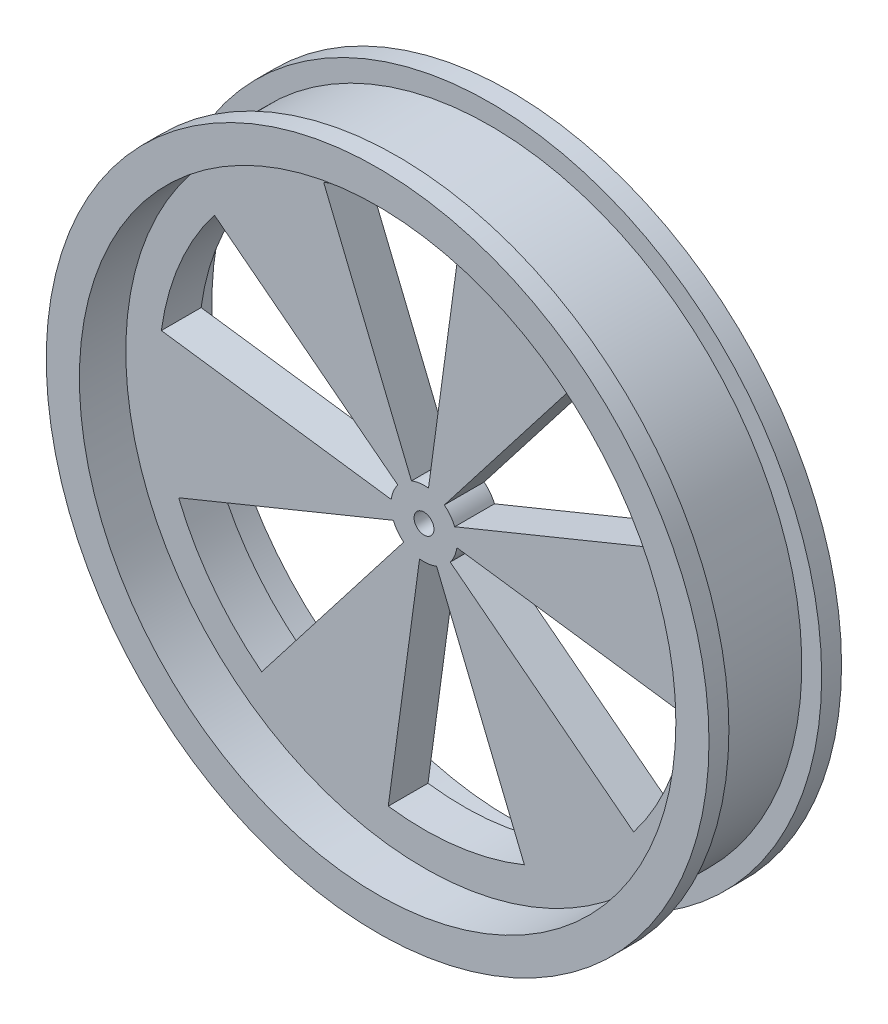
ISO-10303-21;
HEADER;
FILE_DESCRIPTION(('STEP AP214'),'2;1');
FILE_NAME('part.step','',(''),(''),'','','');
FILE_SCHEMA(('AUTOMOTIVE_DESIGN { 1 0 10303 214 1 1 1 1 }'));
ENDSEC;
DATA;
#1=APPLICATION_CONTEXT('core data for automotive mechanical design processes');
#2=APPLICATION_PROTOCOL_DEFINITION('international standard','automotive_design',2000,#1);
#3=PRODUCT_CONTEXT('',#1,'mechanical');
#4=PRODUCT('Part','Part','',(#3));
#5=PRODUCT_RELATED_PRODUCT_CATEGORY('part','',(#4));
#6=PRODUCT_DEFINITION_FORMATION('','',#4);
#7=PRODUCT_DEFINITION_CONTEXT('part definition',#1,'design');
#8=PRODUCT_DEFINITION('design','',#6,#7);
#9=PRODUCT_DEFINITION_SHAPE('','',#8);
#10=(LENGTH_UNIT() NAMED_UNIT(*) SI_UNIT(.MILLI.,.METRE.));
#11=(NAMED_UNIT(*) PLANE_ANGLE_UNIT() SI_UNIT($,.RADIAN.));
#12=(NAMED_UNIT(*) SI_UNIT($,.STERADIAN.) SOLID_ANGLE_UNIT());
#13=UNCERTAINTY_MEASURE_WITH_UNIT(LENGTH_MEASURE(1.E-05),#10,'distance_accuracy_value','');
#14=(GEOMETRIC_REPRESENTATION_CONTEXT(3) GLOBAL_UNCERTAINTY_ASSIGNED_CONTEXT((#13)) GLOBAL_UNIT_ASSIGNED_CONTEXT((#10,
#11,#12)) REPRESENTATION_CONTEXT('',''));
#15=CARTESIAN_POINT('',(0.,0.,0.));
#16=DIRECTION('',(0.,0.,1.));
#17=DIRECTION('',(1.,0.,0.));
#18=AXIS2_PLACEMENT_3D('',#15,#16,#17);
#19=CARTESIAN_POINT('',(0.,0.,20.));
#20=DIRECTION('',(0.,0.,-1.));
#21=DIRECTION('',(-1.,0.,0.));
#22=AXIS2_PLACEMENT_3D('',#19,#20,#21);
#23=CYLINDRICAL_SURFACE('',#22,50.);
#24=CARTESIAN_POINT('',(0.,0.,0.));
#25=DIRECTION('',(0.,0.,1.));
#26=DIRECTION('',(1.,0.,0.));
#27=AXIS2_PLACEMENT_3D('',#24,#25,#26);
#28=CIRCLE('',#27,50.);
#29=CARTESIAN_POINT('',(50.,0.,0.));
#30=VERTEX_POINT('',#29);
#31=EDGE_CURVE('E139',#30,#30,#28,.T.);
#32=ORIENTED_EDGE('',*,*,#31,.T.);
#33=EDGE_LOOP('',(#32));
#34=FACE_BOUND('',#33,.T.);
#35=CARTESIAN_POINT('',(0.,0.,3.00000000000001));
#36=DIRECTION('',(0.,0.,1.));
#37=DIRECTION('',(1.,0.,0.));
#38=AXIS2_PLACEMENT_3D('',#35,#36,#37);
#39=CIRCLE('',#38,50.);
#40=CARTESIAN_POINT('',(50.,0.,3.00000000000001));
#41=VERTEX_POINT('',#40);
#42=EDGE_CURVE('E498',#41,#41,#39,.T.);
#43=ORIENTED_EDGE('',*,*,#42,.F.);
#44=EDGE_LOOP('',(#43));
#45=FACE_BOUND('',#44,.T.);
#46=ADVANCED_FACE('F130',(#34,#45),#23,.T.);
#47=CARTESIAN_POINT('',(0.,0.,7.));
#48=DIRECTION('',(0.,0.,1.));
#49=DIRECTION('',(1.,0.,0.));
#50=AXIS2_PLACEMENT_3D('',#47,#48,#49);
#51=PLANE('',#50);
#52=CARTESIAN_POINT('',(0.,0.,7.));
#53=DIRECTION('',(0.,0.,1.));
#54=DIRECTION('',(1.,0.,0.));
#55=AXIS2_PLACEMENT_3D('',#52,#53,#54);
#56=CIRCLE('',#55,1.5);
#57=CARTESIAN_POINT('',(1.5,0.,7.));
#58=VERTEX_POINT('',#57);
#59=EDGE_CURVE('E811',#58,#58,#56,.F.);
#60=ORIENTED_EDGE('',*,*,#59,.F.);
#61=EDGE_LOOP('',(#60));
#62=FACE_BOUND('',#61,.T.);
#63=CARTESIAN_POINT('',(0.,0.,7.));
#64=DIRECTION('',(0.,0.,1.));
#65=DIRECTION('',(1.,0.,0.));
#66=AXIS2_PLACEMENT_3D('',#63,#64,#65);
#67=CIRCLE('',#66,5.);
#68=CARTESIAN_POINT('',(0.674743038849252,4.9542629957971,7.));
#69=VERTEX_POINT('',#68);
#70=CARTESIAN_POINT('',(-1.89278688522839,4.62788913081411,7.));
#71=VERTEX_POINT('',#70);
#72=EDGE_CURVE('E444',#69,#71,#67,.T.);
#73=ORIENTED_EDGE('',*,*,#72,.F.);
#74=DIRECTION('',(0.13494860776985,0.99085259915942,0.));
#75=VECTOR('',#74,1.);
#76=CARTESIAN_POINT('',(0.,0.,7.));
#77=LINE('',#76,#75);
#78=CARTESIAN_POINT('',(5.39794431079402,39.6341039663768,7.));
#79=VERTEX_POINT('',#78);
#80=EDGE_CURVE('E436',#69,#79,#77,.T.);
#81=ORIENTED_EDGE('',*,*,#80,.T.);
#82=CARTESIAN_POINT('',(0.,0.,7.));
#83=DIRECTION('',(0.,0.,1.));
#84=DIRECTION('',(1.,0.,0.));
#85=AXIS2_PLACEMENT_3D('',#82,#83,#84);
#86=CIRCLE('',#85,40.);
#87=CARTESIAN_POINT('',(-15.1422950818272,37.0231130465129,7.));
#88=VERTEX_POINT('',#87);
#89=EDGE_CURVE('E439',#79,#88,#86,.T.);
#90=ORIENTED_EDGE('',*,*,#89,.T.);
#91=DIRECTION('',(-0.378557377045679,0.925577826162822,0.));
#92=VECTOR('',#91,1.);
#93=CARTESIAN_POINT('',(0.,0.,7.));
#94=LINE('',#93,#92);
#95=EDGE_CURVE('E442',#71,#88,#94,.T.);
#96=ORIENTED_EDGE('',*,*,#95,.F.);
#97=EDGE_LOOP('',(#73,#81,#90,#96));
#98=FACE_BOUND('',#97,.T.);
#99=CARTESIAN_POINT('',(0.,0.,7.));
#100=DIRECTION('',(0.,0.,1.));
#101=DIRECTION('',(1.,0.,0.));
#102=AXIS2_PLACEMENT_3D('',#99,#100,#101);
#103=CIRCLE('',#102,5.);
#104=CARTESIAN_POINT('',(3.95314609196489,-3.06147611056868,7.));
#105=VERTEX_POINT('',#104);
#106=CARTESIAN_POINT('',(4.95426299579711,-0.6747430388492,7.));
#107=VERTEX_POINT('',#106);
#108=EDGE_CURVE('E424',#105,#107,#103,.T.);
#109=ORIENTED_EDGE('',*,*,#108,.F.);
#110=DIRECTION('',(0.790629218392978,-0.612295222113735,0.));
#111=VECTOR('',#110,1.);
#112=CARTESIAN_POINT('',(0.,0.,7.));
#113=LINE('',#112,#111);
#114=CARTESIAN_POINT('',(31.6251687357191,-24.4918088845494,7.));
#115=VERTEX_POINT('',#114);
#116=EDGE_CURVE('E416',#105,#115,#113,.T.);
#117=ORIENTED_EDGE('',*,*,#116,.T.);
#118=CARTESIAN_POINT('',(0.,0.,7.));
#119=DIRECTION('',(0.,0.,1.));
#120=DIRECTION('',(1.,0.,0.));
#121=AXIS2_PLACEMENT_3D('',#118,#119,#120);
#122=CIRCLE('',#121,40.);
#123=CARTESIAN_POINT('',(39.6341039663769,-5.3979443107936,7.));
#124=VERTEX_POINT('',#123);
#125=EDGE_CURVE('E419',#115,#124,#122,.T.);
#126=ORIENTED_EDGE('',*,*,#125,.T.);
#127=DIRECTION('',(0.990852599159422,-0.13494860776984,0.));
#128=VECTOR('',#127,1.);
#129=CARTESIAN_POINT('',(0.,0.,7.));
#130=LINE('',#129,#128);
#131=EDGE_CURVE('E422',#107,#124,#130,.T.);
#132=ORIENTED_EDGE('',*,*,#131,.F.);
#133=EDGE_LOOP('',(#109,#117,#126,#132));
#134=FACE_BOUND('',#133,.T.);
#135=CARTESIAN_POINT('',(0.,0.,7.));
#136=DIRECTION('',(0.,0.,1.));
#137=DIRECTION('',(1.,0.,0.));
#138=AXIS2_PLACEMENT_3D('',#135,#136,#137);
#139=CIRCLE('',#138,5.);
#140=CARTESIAN_POINT('',(4.62788913081409,1.89278688522844,7.));
#141=VERTEX_POINT('',#140);
#142=CARTESIAN_POINT('',(3.06147611056872,3.95314609196486,7.));
#143=VERTEX_POINT('',#142);
#144=EDGE_CURVE('E482',#141,#143,#139,.T.);
#145=ORIENTED_EDGE('',*,*,#144,.F.);
#146=DIRECTION('',(0.925577826162818,0.378557377045689,0.));
#147=VECTOR('',#146,1.);
#148=CARTESIAN_POINT('',(0.,0.,7.));
#149=LINE('',#148,#147);
#150=CARTESIAN_POINT('',(37.0231130465127,15.1422950818275,7.));
#151=VERTEX_POINT('',#150);
#152=EDGE_CURVE('E468',#141,#151,#149,.T.);
#153=ORIENTED_EDGE('',*,*,#152,.T.);
#154=CARTESIAN_POINT('',(0.,0.,7.));
#155=DIRECTION('',(0.,0.,1.));
#156=DIRECTION('',(1.,0.,0.));
#157=AXIS2_PLACEMENT_3D('',#154,#155,#156);
#158=CIRCLE('',#157,40.);
#159=CARTESIAN_POINT('',(24.4918088845497,31.6251687357189,7.));
#160=VERTEX_POINT('',#159);
#161=EDGE_CURVE('E477',#151,#160,#158,.T.);
#162=ORIENTED_EDGE('',*,*,#161,.T.);
#163=DIRECTION('',(0.612295222113744,0.790629218392972,0.));
#164=VECTOR('',#163,1.);
#165=CARTESIAN_POINT('',(0.,0.,7.));
#166=LINE('',#165,#164);
#167=EDGE_CURVE('E480',#143,#160,#166,.T.);
#168=ORIENTED_EDGE('',*,*,#167,.F.);
#169=EDGE_LOOP('',(#145,#153,#162,#168));
#170=FACE_BOUND('',#169,.T.);
#171=CARTESIAN_POINT('',(0.,0.,7.));
#172=DIRECTION('',(0.,0.,1.));
#173=DIRECTION('',(1.,0.,0.));
#174=AXIS2_PLACEMENT_3D('',#171,#172,#173);
#175=CIRCLE('',#174,45.);
#176=CARTESIAN_POINT('',(45.,0.,7.));
#177=VERTEX_POINT('',#176);
#178=EDGE_CURVE('E491',#177,#177,#175,.T.);
#179=ORIENTED_EDGE('',*,*,#178,.F.);
#180=EDGE_LOOP('',(#179));
#181=FACE_BOUND('',#180,.T.);
#182=CARTESIAN_POINT('',(0.,0.,7.));
#183=DIRECTION('',(0.,0.,1.));
#184=DIRECTION('',(1.,0.,0.));
#185=AXIS2_PLACEMENT_3D('',#182,#183,#184);
#186=CIRCLE('',#185,5.);
#187=CARTESIAN_POINT('',(-4.6278891308141,-1.89278688522841,7.));
#188=VERTEX_POINT('',#187);
#189=CARTESIAN_POINT('',(-3.06147611056869,-3.95314609196488,7.));
#190=VERTEX_POINT('',#189);
#191=EDGE_CURVE('E414',#188,#190,#186,.T.);
#192=ORIENTED_EDGE('',*,*,#191,.F.);
#193=DIRECTION('',(-0.925577826162821,-0.378557377045682,0.));
#194=VECTOR('',#193,1.);
#195=CARTESIAN_POINT('',(0.,0.,7.));
#196=LINE('',#195,#194);
#197=CARTESIAN_POINT('',(-37.0231130465128,-15.1422950818273,7.));
#198=VERTEX_POINT('',#197);
#199=EDGE_CURVE('E337',#188,#198,#196,.T.);
#200=ORIENTED_EDGE('',*,*,#199,.T.);
#201=CARTESIAN_POINT('',(0.,0.,7.));
#202=DIRECTION('',(0.,0.,1.));
#203=DIRECTION('',(1.,0.,0.));
#204=AXIS2_PLACEMENT_3D('',#201,#202,#203);
#205=CIRCLE('',#204,40.);
#206=CARTESIAN_POINT('',(-24.4918088845495,-31.6251687357191,7.));
#207=VERTEX_POINT('',#206);
#208=EDGE_CURVE('E409',#198,#207,#205,.T.);
#209=ORIENTED_EDGE('',*,*,#208,.T.);
#210=DIRECTION('',(-0.612295222113738,-0.790629218392976,0.));
#211=VECTOR('',#210,1.);
#212=CARTESIAN_POINT('',(0.,0.,7.));
#213=LINE('',#212,#211);
#214=EDGE_CURVE('E412',#190,#207,#213,.T.);
#215=ORIENTED_EDGE('',*,*,#214,.F.);
#216=EDGE_LOOP('',(#192,#200,#209,#215));
#217=FACE_BOUND('',#216,.T.);
#218=CARTESIAN_POINT('',(0.,0.,7.));
#219=DIRECTION('',(0.,0.,1.));
#220=DIRECTION('',(1.,0.,0.));
#221=AXIS2_PLACEMENT_3D('',#218,#219,#220);
#222=CIRCLE('',#221,5.);
#223=CARTESIAN_POINT('',(-0.674743038849217,-4.95426299579711,7.));
#224=VERTEX_POINT('',#223);
#225=CARTESIAN_POINT('',(1.89278688522843,-4.6278891308141,7.));
#226=VERTEX_POINT('',#225);
#227=EDGE_CURVE('E434',#224,#226,#222,.T.);
#228=ORIENTED_EDGE('',*,*,#227,.F.);
#229=DIRECTION('',(-0.134948607769843,-0.990852599159421,0.));
#230=VECTOR('',#229,1.);
#231=CARTESIAN_POINT('',(0.,0.,7.));
#232=LINE('',#231,#230);
#233=CARTESIAN_POINT('',(-5.39794431079374,-39.6341039663769,7.));
#234=VERTEX_POINT('',#233);
#235=EDGE_CURVE('E426',#224,#234,#232,.T.);
#236=ORIENTED_EDGE('',*,*,#235,.T.);
#237=CARTESIAN_POINT('',(0.,0.,7.));
#238=DIRECTION('',(0.,0.,1.));
#239=DIRECTION('',(1.,0.,0.));
#240=AXIS2_PLACEMENT_3D('',#237,#238,#239);
#241=CIRCLE('',#240,40.);
#242=CARTESIAN_POINT('',(15.1422950818274,-37.0231130465128,7.));
#243=VERTEX_POINT('',#242);
#244=EDGE_CURVE('E429',#234,#243,#241,.T.);
#245=ORIENTED_EDGE('',*,*,#244,.T.);
#246=DIRECTION('',(0.378557377045685,-0.92557782616282,0.));
#247=VECTOR('',#246,1.);
#248=CARTESIAN_POINT('',(0.,0.,7.));
#249=LINE('',#248,#247);
#250=EDGE_CURVE('E432',#226,#243,#249,.T.);
#251=ORIENTED_EDGE('',*,*,#250,.F.);
#252=EDGE_LOOP('',(#228,#236,#245,#251));
#253=FACE_BOUND('',#252,.T.);
#254=CARTESIAN_POINT('',(0.,0.,7.));
#255=DIRECTION('',(0.,0.,1.));
#256=DIRECTION('',(1.,0.,0.));
#257=AXIS2_PLACEMENT_3D('',#254,#255,#256);
#258=CIRCLE('',#257,5.);
#259=CARTESIAN_POINT('',(-3.95314609196487,3.0614761105687,7.));
#260=VERTEX_POINT('',#259);
#261=CARTESIAN_POINT('',(-4.9542629957971,0.674743038849235,7.));
#262=VERTEX_POINT('',#261);
#263=EDGE_CURVE('E451',#260,#262,#258,.T.);
#264=ORIENTED_EDGE('',*,*,#263,.F.);
#265=DIRECTION('',(-0.790629218392974,0.612295222113741,0.));
#266=VECTOR('',#265,1.);
#267=CARTESIAN_POINT('',(0.,0.,7.));
#268=LINE('',#267,#266);
#269=CARTESIAN_POINT('',(-31.625168735719,24.4918088845496,7.));
#270=VERTEX_POINT('',#269);
#271=EDGE_CURVE('E446',#260,#270,#268,.T.);
#272=ORIENTED_EDGE('',*,*,#271,.T.);
#273=CARTESIAN_POINT('',(0.,0.,7.));
#274=DIRECTION('',(0.,0.,1.));
#275=DIRECTION('',(1.,0.,0.));
#276=AXIS2_PLACEMENT_3D('',#273,#274,#275);
#277=CIRCLE('',#276,40.);
#278=CARTESIAN_POINT('',(-39.6341039663768,5.39794431079388,7.));
#279=VERTEX_POINT('',#278);
#280=EDGE_CURVE('E298',#270,#279,#277,.T.);
#281=ORIENTED_EDGE('',*,*,#280,.T.);
#282=DIRECTION('',(-0.990852599159421,0.134948607769847,0.));
#283=VECTOR('',#282,1.);
#284=CARTESIAN_POINT('',(0.,0.,7.));
#285=LINE('',#284,#283);
#286=EDGE_CURVE('E449',#262,#279,#285,.T.);
#287=ORIENTED_EDGE('',*,*,#286,.F.);
#288=EDGE_LOOP('',(#264,#272,#281,#287));
#289=FACE_BOUND('',#288,.T.);
#290=ADVANCED_FACE('F523',(#62,#98,#134,#170,#181,#217,#253,#289),#51,.F.);
#291=CARTESIAN_POINT('',(0.,0.,13.));
#292=DIRECTION('',(0.,0.,1.));
#293=DIRECTION('',(1.,0.,0.));
#294=AXIS2_PLACEMENT_3D('',#291,#292,#293);
#295=PLANE('',#294);
#296=CARTESIAN_POINT('',(0.,0.,13.));
#297=DIRECTION('',(0.,0.,1.));
#298=DIRECTION('',(1.,0.,0.));
#299=AXIS2_PLACEMENT_3D('',#296,#297,#298);
#300=CIRCLE('',#299,1.5);
#301=CARTESIAN_POINT('',(1.5,0.,13.));
#302=VERTEX_POINT('',#301);
#303=EDGE_CURVE('E134',#302,#302,#300,.F.);
#304=ORIENTED_EDGE('',*,*,#303,.T.);
#305=EDGE_LOOP('',(#304));
#306=FACE_BOUND('',#305,.T.);
#307=CARTESIAN_POINT('',(0.,0.,13.));
#308=DIRECTION('',(0.,0.,1.));
#309=DIRECTION('',(1.,0.,0.));
#310=AXIS2_PLACEMENT_3D('',#307,#308,#309);
#311=CIRCLE('',#310,45.);
#312=CARTESIAN_POINT('',(45.,0.,13.));
#313=VERTEX_POINT('',#312);
#314=EDGE_CURVE('E485',#313,#313,#311,.T.);
#315=ORIENTED_EDGE('',*,*,#314,.T.);
#316=EDGE_LOOP('',(#315));
#317=FACE_BOUND('',#316,.T.);
#318=DIRECTION('',(0.925577826162818,0.378557377045689,0.));
#319=VECTOR('',#318,1.);
#320=CARTESIAN_POINT('',(0.,0.,13.));
#321=LINE('',#320,#319);
#322=CARTESIAN_POINT('',(4.62788913081409,1.89278688522844,13.));
#323=VERTEX_POINT('',#322);
#324=CARTESIAN_POINT('',(37.0231130465127,15.1422950818275,13.));
#325=VERTEX_POINT('',#324);
#326=EDGE_CURVE('E456',#323,#325,#321,.T.);
#327=ORIENTED_EDGE('',*,*,#326,.F.);
#328=CARTESIAN_POINT('',(0.,0.,13.));
#329=DIRECTION('',(0.,0.,1.));
#330=DIRECTION('',(1.,0.,0.));
#331=AXIS2_PLACEMENT_3D('',#328,#329,#330);
#332=CIRCLE('',#331,5.);
#333=CARTESIAN_POINT('',(3.06147611056872,3.95314609196486,13.));
#334=VERTEX_POINT('',#333);
#335=EDGE_CURVE('E453',#323,#334,#332,.T.);
#336=ORIENTED_EDGE('',*,*,#335,.T.);
#337=DIRECTION('',(0.612295222113743,0.790629218392972,0.));
#338=VECTOR('',#337,1.);
#339=CARTESIAN_POINT('',(0.,0.,13.));
#340=LINE('',#339,#338);
#341=CARTESIAN_POINT('',(24.4918088845497,31.6251687357189,13.));
#342=VERTEX_POINT('',#341);
#343=EDGE_CURVE('E462',#334,#342,#340,.T.);
#344=ORIENTED_EDGE('',*,*,#343,.T.);
#345=CARTESIAN_POINT('',(0.,0.,13.));
#346=DIRECTION('',(0.,0.,1.));
#347=DIRECTION('',(1.,0.,0.));
#348=AXIS2_PLACEMENT_3D('',#345,#346,#347);
#349=CIRCLE('',#348,40.);
#350=EDGE_CURVE('E459',#325,#342,#349,.T.);
#351=ORIENTED_EDGE('',*,*,#350,.F.);
#352=EDGE_LOOP('',(#327,#336,#344,#351));
#353=FACE_BOUND('',#352,.T.);
#354=DIRECTION('',(-0.925577826162821,-0.378557377045682,0.));
#355=VECTOR('',#354,1.);
#356=CARTESIAN_POINT('',(0.,0.,13.));
#357=LINE('',#356,#355);
#358=CARTESIAN_POINT('',(-4.6278891308141,-1.89278688522841,13.));
#359=VERTEX_POINT('',#358);
#360=CARTESIAN_POINT('',(-37.0231130465128,-15.1422950818273,13.));
#361=VERTEX_POINT('',#360);
#362=EDGE_CURVE('E389',#359,#361,#357,.T.);
#363=ORIENTED_EDGE('',*,*,#362,.F.);
#364=CARTESIAN_POINT('',(0.,0.,13.));
#365=DIRECTION('',(0.,0.,1.));
#366=DIRECTION('',(1.,0.,0.));
#367=AXIS2_PLACEMENT_3D('',#364,#365,#366);
#368=CIRCLE('',#367,5.);
#369=CARTESIAN_POINT('',(-3.06147611056869,-3.95314609196488,13.));
#370=VERTEX_POINT('',#369);
#371=EDGE_CURVE('E380',#359,#370,#368,.T.);
#372=ORIENTED_EDGE('',*,*,#371,.T.);
#373=DIRECTION('',(-0.612295222113738,-0.790629218392976,0.));
#374=VECTOR('',#373,1.);
#375=CARTESIAN_POINT('',(0.,0.,13.));
#376=LINE('',#375,#374);
#377=CARTESIAN_POINT('',(-24.4918088845495,-31.6251687357191,13.));
#378=VERTEX_POINT('',#377);
#379=EDGE_CURVE('E395',#370,#378,#376,.T.);
#380=ORIENTED_EDGE('',*,*,#379,.T.);
#381=CARTESIAN_POINT('',(0.,0.,13.));
#382=DIRECTION('',(0.,0.,1.));
#383=DIRECTION('',(1.,0.,0.));
#384=AXIS2_PLACEMENT_3D('',#381,#382,#383);
#385=CIRCLE('',#384,40.);
#386=EDGE_CURVE('E392',#361,#378,#385,.T.);
#387=ORIENTED_EDGE('',*,*,#386,.F.);
#388=EDGE_LOOP('',(#363,#372,#380,#387));
#389=FACE_BOUND('',#388,.T.);
#390=DIRECTION('',(0.790629218392978,-0.612295222113735,0.));
#391=VECTOR('',#390,1.);
#392=CARTESIAN_POINT('',(0.,0.,13.));
#393=LINE('',#392,#391);
#394=CARTESIAN_POINT('',(3.95314609196489,-3.06147611056868,13.));
#395=VERTEX_POINT('',#394);
#396=CARTESIAN_POINT('',(31.6251687357191,-24.4918088845494,13.));
#397=VERTEX_POINT('',#396);
#398=EDGE_CURVE('E346',#395,#397,#393,.T.);
#399=ORIENTED_EDGE('',*,*,#398,.F.);
#400=CARTESIAN_POINT('',(0.,0.,13.));
#401=DIRECTION('',(0.,0.,1.));
#402=DIRECTION('',(1.,0.,0.));
#403=AXIS2_PLACEMENT_3D('',#400,#401,#402);
#404=CIRCLE('',#403,5.);
#405=CARTESIAN_POINT('',(4.95426299579711,-0.6747430388492,13.));
#406=VERTEX_POINT('',#405);
#407=EDGE_CURVE('E343',#395,#406,#404,.T.);
#408=ORIENTED_EDGE('',*,*,#407,.T.);
#409=DIRECTION('',(0.990852599159422,-0.13494860776984,0.));
#410=VECTOR('',#409,1.);
#411=CARTESIAN_POINT('',(0.,0.,13.));
#412=LINE('',#411,#410);
#413=CARTESIAN_POINT('',(39.6341039663769,-5.3979443107936,13.));
#414=VERTEX_POINT('',#413);
#415=EDGE_CURVE('E353',#406,#414,#412,.T.);
#416=ORIENTED_EDGE('',*,*,#415,.T.);
#417=CARTESIAN_POINT('',(0.,0.,13.));
#418=DIRECTION('',(0.,0.,1.));
#419=DIRECTION('',(1.,0.,0.));
#420=AXIS2_PLACEMENT_3D('',#417,#418,#419);
#421=CIRCLE('',#420,40.);
#422=EDGE_CURVE('E350',#397,#414,#421,.T.);
#423=ORIENTED_EDGE('',*,*,#422,.F.);
#424=EDGE_LOOP('',(#399,#408,#416,#423));
#425=FACE_BOUND('',#424,.T.);
#426=DIRECTION('',(-0.134948607769843,-0.990852599159421,0.));
#427=VECTOR('',#426,1.);
#428=CARTESIAN_POINT('',(0.,0.,13.));
#429=LINE('',#428,#427);
#430=CARTESIAN_POINT('',(-0.674743038849217,-4.95426299579711,13.));
#431=VERTEX_POINT('',#430);
#432=CARTESIAN_POINT('',(-5.39794431079374,-39.6341039663769,13.));
#433=VERTEX_POINT('',#432);
#434=EDGE_CURVE('E368',#431,#433,#429,.T.);
#435=ORIENTED_EDGE('',*,*,#434,.F.);
#436=CARTESIAN_POINT('',(0.,0.,13.));
#437=DIRECTION('',(0.,0.,1.));
#438=DIRECTION('',(1.,0.,0.));
#439=AXIS2_PLACEMENT_3D('',#436,#437,#438);
#440=CIRCLE('',#439,5.);
#441=CARTESIAN_POINT('',(1.89278688522843,-4.6278891308141,13.));
#442=VERTEX_POINT('',#441);
#443=EDGE_CURVE('E359',#431,#442,#440,.T.);
#444=ORIENTED_EDGE('',*,*,#443,.T.);
#445=DIRECTION('',(0.378557377045685,-0.92557782616282,0.));
#446=VECTOR('',#445,1.);
#447=CARTESIAN_POINT('',(0.,0.,13.));
#448=LINE('',#447,#446);
#449=CARTESIAN_POINT('',(15.1422950818274,-37.0231130465128,13.));
#450=VERTEX_POINT('',#449);
#451=EDGE_CURVE('E374',#442,#450,#448,.T.);
#452=ORIENTED_EDGE('',*,*,#451,.T.);
#453=CARTESIAN_POINT('',(0.,0.,13.));
#454=DIRECTION('',(0.,0.,1.));
#455=DIRECTION('',(1.,0.,0.));
#456=AXIS2_PLACEMENT_3D('',#453,#454,#455);
#457=CIRCLE('',#456,40.);
#458=EDGE_CURVE('E371',#433,#450,#457,.T.);
#459=ORIENTED_EDGE('',*,*,#458,.F.);
#460=EDGE_LOOP('',(#435,#444,#452,#459));
#461=FACE_BOUND('',#460,.T.);
#462=DIRECTION('',(0.13494860776985,0.99085259915942,0.));
#463=VECTOR('',#462,1.);
#464=CARTESIAN_POINT('',(0.,0.,13.));
#465=LINE('',#464,#463);
#466=CARTESIAN_POINT('',(0.674743038849252,4.9542629957971,13.));
#467=VERTEX_POINT('',#466);
#468=CARTESIAN_POINT('',(5.39794431079402,39.6341039663768,13.));
#469=VERTEX_POINT('',#468);
#470=EDGE_CURVE('E326',#467,#469,#465,.T.);
#471=ORIENTED_EDGE('',*,*,#470,.F.);
#472=CARTESIAN_POINT('',(0.,0.,13.));
#473=DIRECTION('',(0.,0.,1.));
#474=DIRECTION('',(1.,0.,0.));
#475=AXIS2_PLACEMENT_3D('',#472,#473,#474);
#476=CIRCLE('',#475,5.);
#477=CARTESIAN_POINT('',(-1.89278688522839,4.62788913081411,13.));
#478=VERTEX_POINT('',#477);
#479=EDGE_CURVE('E321',#467,#478,#476,.T.);
#480=ORIENTED_EDGE('',*,*,#479,.T.);
#481=DIRECTION('',(-0.378557377045679,0.925577826162822,0.));
#482=VECTOR('',#481,1.);
#483=CARTESIAN_POINT('',(0.,0.,13.));
#484=LINE('',#483,#482);
#485=CARTESIAN_POINT('',(-15.1422950818272,37.0231130465129,13.));
#486=VERTEX_POINT('',#485);
#487=EDGE_CURVE('E331',#478,#486,#484,.T.);
#488=ORIENTED_EDGE('',*,*,#487,.T.);
#489=CARTESIAN_POINT('',(0.,0.,13.));
#490=DIRECTION('',(0.,0.,1.));
#491=DIRECTION('',(1.,0.,0.));
#492=AXIS2_PLACEMENT_3D('',#489,#490,#491);
#493=CIRCLE('',#492,40.);
#494=EDGE_CURVE('E328',#469,#486,#493,.T.);
#495=ORIENTED_EDGE('',*,*,#494,.F.);
#496=EDGE_LOOP('',(#471,#480,#488,#495));
#497=FACE_BOUND('',#496,.T.);
#498=DIRECTION('',(-0.790629218392974,0.612295222113741,0.));
#499=VECTOR('',#498,1.);
#500=CARTESIAN_POINT('',(0.,0.,13.));
#501=LINE('',#500,#499);
#502=CARTESIAN_POINT('',(-3.95314609196487,3.06147611056871,13.));
#503=VERTEX_POINT('',#502);
#504=CARTESIAN_POINT('',(-31.625168735719,24.4918088845496,13.));
#505=VERTEX_POINT('',#504);
#506=EDGE_CURVE('E305',#503,#505,#501,.T.);
#507=ORIENTED_EDGE('',*,*,#506,.F.);
#508=CARTESIAN_POINT('',(0.,0.,13.));
#509=DIRECTION('',(0.,0.,1.));
#510=DIRECTION('',(1.,0.,0.));
#511=AXIS2_PLACEMENT_3D('',#508,#509,#510);
#512=CIRCLE('',#511,5.);
#513=CARTESIAN_POINT('',(-4.9542629957971,0.674743038849235,13.));
#514=VERTEX_POINT('',#513);
#515=EDGE_CURVE('E310',#503,#514,#512,.T.);
#516=ORIENTED_EDGE('',*,*,#515,.T.);
#517=DIRECTION('',(-0.990852599159421,0.134948607769847,0.));
#518=VECTOR('',#517,1.);
#519=CARTESIAN_POINT('',(0.,0.,13.));
#520=LINE('',#519,#518);
#521=CARTESIAN_POINT('',(-39.6341039663768,5.39794431079388,13.));
#522=VERTEX_POINT('',#521);
#523=EDGE_CURVE('E314',#514,#522,#520,.T.);
#524=ORIENTED_EDGE('',*,*,#523,.T.);
#525=CARTESIAN_POINT('',(0.,0.,13.));
#526=DIRECTION('',(0.,0.,1.));
#527=DIRECTION('',(1.,0.,0.));
#528=AXIS2_PLACEMENT_3D('',#525,#526,#527);
#529=CIRCLE('',#528,40.);
#530=EDGE_CURVE('E295',#505,#522,#529,.T.);
#531=ORIENTED_EDGE('',*,*,#530,.F.);
#532=EDGE_LOOP('',(#507,#516,#524,#531));
#533=FACE_BOUND('',#532,.T.);
#534=ADVANCED_FACE('F312',(#306,#317,#353,#389,#425,#461,#497,#533),#295,.T.);
#535=CARTESIAN_POINT('',(0.,0.,17.));
#536=DIRECTION('',(0.,0.,1.));
#537=DIRECTION('',(1.,0.,0.));
#538=AXIS2_PLACEMENT_3D('',#535,#536,#537);
#539=CIRCLE('',#538,50.);
#540=CARTESIAN_POINT('',(50.,0.,17.));
#541=VERTEX_POINT('',#540);
#542=EDGE_CURVE('E347',#541,#541,#539,.T.);
#543=ORIENTED_EDGE('',*,*,#542,.T.);
#544=EDGE_LOOP('',(#543));
#545=FACE_BOUND('',#544,.T.);
#546=CARTESIAN_POINT('',(0.,0.,20.));
#547=DIRECTION('',(0.,0.,1.));
#548=DIRECTION('',(1.,0.,0.));
#549=AXIS2_PLACEMENT_3D('',#546,#547,#548);
#550=CIRCLE('',#549,50.);
#551=CARTESIAN_POINT('',(50.,0.,20.));
#552=VERTEX_POINT('',#551);
#553=EDGE_CURVE('E12',#552,#552,#550,.T.);
#554=ORIENTED_EDGE('',*,*,#553,.F.);
#555=EDGE_LOOP('',(#554));
#556=FACE_BOUND('',#555,.T.);
#557=ADVANCED_FACE('F132',(#545,#556),#23,.T.);
#558=CARTESIAN_POINT('',(0.,0.,20.));
#559=DIRECTION('',(0.,0.,1.));
#560=DIRECTION('',(1.,0.,0.));
#561=AXIS2_PLACEMENT_3D('',#558,#559,#560);
#562=PLANE('',#561);
#563=CARTESIAN_POINT('',(0.,0.,20.));
#564=DIRECTION('',(0.,0.,1.));
#565=DIRECTION('',(1.,0.,0.));
#566=AXIS2_PLACEMENT_3D('',#563,#564,#565);
#567=CIRCLE('',#566,45.);
#568=CARTESIAN_POINT('',(45.,0.,20.));
#569=VERTEX_POINT('',#568);
#570=EDGE_CURVE('E484',#569,#569,#567,.T.);
#571=ORIENTED_EDGE('',*,*,#570,.F.);
#572=EDGE_LOOP('',(#571));
#573=FACE_BOUND('',#572,.T.);
#574=ORIENTED_EDGE('',*,*,#553,.T.);
#575=EDGE_LOOP('',(#574));
#576=FACE_BOUND('',#575,.T.);
#577=ADVANCED_FACE('F532',(#573,#576),#562,.T.);
#578=CARTESIAN_POINT('',(0.,0.,0.));
#579=DIRECTION('',(0.,0.,1.));
#580=DIRECTION('',(1.,0.,0.));
#581=AXIS2_PLACEMENT_3D('',#578,#579,#580);
#582=PLANE('',#581);
#583=CARTESIAN_POINT('',(0.,0.,0.));
#584=DIRECTION('',(0.,0.,1.));
#585=DIRECTION('',(1.,0.,0.));
#586=AXIS2_PLACEMENT_3D('',#583,#584,#585);
#587=CIRCLE('',#586,45.);
#588=CARTESIAN_POINT('',(45.,0.,0.));
#589=VERTEX_POINT('',#588);
#590=EDGE_CURVE('E488',#589,#589,#587,.T.);
#591=ORIENTED_EDGE('',*,*,#590,.T.);
#592=EDGE_LOOP('',(#591));
#593=FACE_BOUND('',#592,.T.);
#594=ORIENTED_EDGE('',*,*,#31,.F.);
#595=EDGE_LOOP('',(#594));
#596=FACE_BOUND('',#595,.T.);
#597=ADVANCED_FACE('F537',(#593,#596),#582,.F.);
#598=CARTESIAN_POINT('',(0.,0.,7.));
#599=DIRECTION('',(0.,0.,-1.));
#600=DIRECTION('',(-1.,0.,0.));
#601=AXIS2_PLACEMENT_3D('',#598,#599,#600);
#602=CYLINDRICAL_SURFACE('',#601,45.);
#603=ORIENTED_EDGE('',*,*,#178,.T.);
#604=EDGE_LOOP('',(#603));
#605=FACE_BOUND('',#604,.T.);
#606=ORIENTED_EDGE('',*,*,#590,.F.);
#607=EDGE_LOOP('',(#606));
#608=FACE_BOUND('',#607,.T.);
#609=ADVANCED_FACE('F552',(#605,#608),#602,.F.);
#610=CARTESIAN_POINT('',(0.,0.,13.));
#611=DIRECTION('',(0.,0.,1.));
#612=DIRECTION('',(1.,0.,0.));
#613=AXIS2_PLACEMENT_3D('',#610,#611,#612);
#614=CYLINDRICAL_SURFACE('',#613,45.);
#615=ORIENTED_EDGE('',*,*,#314,.F.);
#616=EDGE_LOOP('',(#615));
#617=FACE_BOUND('',#616,.T.);
#618=ORIENTED_EDGE('',*,*,#570,.T.);
#619=EDGE_LOOP('',(#618));
#620=FACE_BOUND('',#619,.T.);
#621=ADVANCED_FACE('F550',(#617,#620),#614,.F.);
#622=CARTESIAN_POINT('',(0.,0.,0.));
#623=DIRECTION('',(0.,0.,1.));
#624=DIRECTION('',(1.,0.,0.));
#625=AXIS2_PLACEMENT_3D('',#622,#623,#624);
#626=CYLINDRICAL_SURFACE('',#625,5.);
#627=ORIENTED_EDGE('',*,*,#144,.T.);
#628=DIRECTION('',(0.,0.,1.));
#629=VECTOR('',#628,1.);
#630=CARTESIAN_POINT('',(3.06147611056872,3.95314609196486,0.));
#631=LINE('',#630,#629);
#632=EDGE_CURVE('E466',#143,#334,#631,.T.);
#633=ORIENTED_EDGE('',*,*,#632,.T.);
#634=ORIENTED_EDGE('',*,*,#335,.F.);
#635=DIRECTION('',(0.,0.,1.));
#636=VECTOR('',#635,1.);
#637=CARTESIAN_POINT('',(4.62788913081409,1.89278688522844,0.));
#638=LINE('',#637,#636);
#639=EDGE_CURVE('E465',#141,#323,#638,.T.);
#640=ORIENTED_EDGE('',*,*,#639,.F.);
#641=EDGE_LOOP('',(#627,#633,#634,#640));
#642=FACE_BOUND('',#641,.T.);
#643=ADVANCED_FACE('F548',(#642),#626,.T.);
#644=CARTESIAN_POINT('',(0.,0.,0.));
#645=DIRECTION('',(0.790629218392972,-0.612295222113744,0.));
#646=DIRECTION('',(0.612295222113744,0.790629218392972,0.));
#647=AXIS2_PLACEMENT_3D('',#644,#645,#646);
#648=PLANE('',#647);
#649=ORIENTED_EDGE('',*,*,#167,.T.);
#650=DIRECTION('',(0.,0.,1.));
#651=VECTOR('',#650,1.);
#652=CARTESIAN_POINT('',(24.4918088845497,31.6251687357189,0.));
#653=LINE('',#652,#651);
#654=EDGE_CURVE('E469',#160,#342,#653,.T.);
#655=ORIENTED_EDGE('',*,*,#654,.T.);
#656=ORIENTED_EDGE('',*,*,#343,.F.);
#657=ORIENTED_EDGE('',*,*,#632,.F.);
#658=EDGE_LOOP('',(#649,#655,#656,#657));
#659=FACE_BOUND('',#658,.T.);
#660=ADVANCED_FACE('F581',(#659),#648,.T.);
#661=CARTESIAN_POINT('',(0.,0.,0.));
#662=DIRECTION('',(0.,0.,1.));
#663=DIRECTION('',(1.,0.,0.));
#664=AXIS2_PLACEMENT_3D('',#661,#662,#663);
#665=CYLINDRICAL_SURFACE('',#664,40.);
#666=DIRECTION('',(0.,0.,1.));
#667=VECTOR('',#666,1.);
#668=CARTESIAN_POINT('',(37.0231130465127,15.1422950818275,0.));
#669=LINE('',#668,#667);
#670=EDGE_CURVE('E471',#151,#325,#669,.T.);
#671=ORIENTED_EDGE('',*,*,#670,.T.);
#672=ORIENTED_EDGE('',*,*,#350,.T.);
#673=ORIENTED_EDGE('',*,*,#654,.F.);
#674=ORIENTED_EDGE('',*,*,#161,.F.);
#675=EDGE_LOOP('',(#671,#672,#673,#674));
#676=FACE_BOUND('',#675,.T.);
#677=ADVANCED_FACE('F588',(#676),#665,.F.);
#678=CARTESIAN_POINT('',(0.,0.,0.));
#679=DIRECTION('',(0.378557377045689,-0.925577826162818,0.));
#680=DIRECTION('',(0.925577826162818,0.378557377045689,0.));
#681=AXIS2_PLACEMENT_3D('',#678,#679,#680);
#682=PLANE('',#681);
#683=ORIENTED_EDGE('',*,*,#639,.T.);
#684=ORIENTED_EDGE('',*,*,#326,.T.);
#685=ORIENTED_EDGE('',*,*,#670,.F.);
#686=ORIENTED_EDGE('',*,*,#152,.F.);
#687=EDGE_LOOP('',(#683,#684,#685,#686));
#688=FACE_BOUND('',#687,.T.);
#689=ADVANCED_FACE('F596',(#688),#682,.F.);
#690=CARTESIAN_POINT('',(0.,0.,0.));
#691=DIRECTION('',(0.,0.,1.));
#692=DIRECTION('',(1.,0.,0.));
#693=AXIS2_PLACEMENT_3D('',#690,#691,#692);
#694=CYLINDRICAL_SURFACE('',#693,5.);
#695=ORIENTED_EDGE('',*,*,#191,.T.);
#696=DIRECTION('',(0.,0.,1.));
#697=VECTOR('',#696,1.);
#698=CARTESIAN_POINT('',(-3.06147611056869,-3.95314609196488,0.));
#699=LINE('',#698,#697);
#700=EDGE_CURVE('E399',#190,#370,#699,.T.);
#701=ORIENTED_EDGE('',*,*,#700,.T.);
#702=ORIENTED_EDGE('',*,*,#371,.F.);
#703=DIRECTION('',(0.,0.,1.));
#704=VECTOR('',#703,1.);
#705=CARTESIAN_POINT('',(-4.6278891308141,-1.89278688522841,0.));
#706=LINE('',#705,#704);
#707=EDGE_CURVE('E398',#188,#359,#706,.T.);
#708=ORIENTED_EDGE('',*,*,#707,.F.);
#709=EDGE_LOOP('',(#695,#701,#702,#708));
#710=FACE_BOUND('',#709,.T.);
#711=ADVANCED_FACE('F604',(#710),#694,.T.);
#712=CARTESIAN_POINT('',(0.,0.,0.));
#713=DIRECTION('',(-0.790629218392976,0.612295222113738,0.));
#714=DIRECTION('',(-0.612295222113738,-0.790629218392976,0.));
#715=AXIS2_PLACEMENT_3D('',#712,#713,#714);
#716=PLANE('',#715);
#717=ORIENTED_EDGE('',*,*,#214,.T.);
#718=DIRECTION('',(0.,0.,1.));
#719=VECTOR('',#718,1.);
#720=CARTESIAN_POINT('',(-24.4918088845495,-31.6251687357191,0.));
#721=LINE('',#720,#719);
#722=EDGE_CURVE('E401',#207,#378,#721,.T.);
#723=ORIENTED_EDGE('',*,*,#722,.T.);
#724=ORIENTED_EDGE('',*,*,#379,.F.);
#725=ORIENTED_EDGE('',*,*,#700,.F.);
#726=EDGE_LOOP('',(#717,#723,#724,#725));
#727=FACE_BOUND('',#726,.T.);
#728=ADVANCED_FACE('F611',(#727),#716,.T.);
#729=CARTESIAN_POINT('',(0.,0.,0.));
#730=DIRECTION('',(0.,0.,1.));
#731=DIRECTION('',(1.,0.,0.));
#732=AXIS2_PLACEMENT_3D('',#729,#730,#731);
#733=CYLINDRICAL_SURFACE('',#732,40.);
#734=DIRECTION('',(0.,0.,1.));
#735=VECTOR('',#734,1.);
#736=CARTESIAN_POINT('',(-37.0231130465128,-15.1422950818273,0.));
#737=LINE('',#736,#735);
#738=EDGE_CURVE('E403',#198,#361,#737,.T.);
#739=ORIENTED_EDGE('',*,*,#738,.T.);
#740=ORIENTED_EDGE('',*,*,#386,.T.);
#741=ORIENTED_EDGE('',*,*,#722,.F.);
#742=ORIENTED_EDGE('',*,*,#208,.F.);
#743=EDGE_LOOP('',(#739,#740,#741,#742));
#744=FACE_BOUND('',#743,.T.);
#745=ADVANCED_FACE('F619',(#744),#733,.F.);
#746=CARTESIAN_POINT('',(0.,0.,0.));
#747=DIRECTION('',(-0.378557377045682,0.925577826162821,0.));
#748=DIRECTION('',(-0.925577826162821,-0.378557377045682,0.));
#749=AXIS2_PLACEMENT_3D('',#746,#747,#748);
#750=PLANE('',#749);
#751=ORIENTED_EDGE('',*,*,#707,.T.);
#752=ORIENTED_EDGE('',*,*,#362,.T.);
#753=ORIENTED_EDGE('',*,*,#738,.F.);
#754=ORIENTED_EDGE('',*,*,#199,.F.);
#755=EDGE_LOOP('',(#751,#752,#753,#754));
#756=FACE_BOUND('',#755,.T.);
#757=ADVANCED_FACE('F627',(#756),#750,.F.);
#758=CARTESIAN_POINT('',(0.,0.,0.));
#759=DIRECTION('',(0.,0.,1.));
#760=DIRECTION('',(1.,0.,0.));
#761=AXIS2_PLACEMENT_3D('',#758,#759,#760);
#762=CYLINDRICAL_SURFACE('',#761,5.);
#763=ORIENTED_EDGE('',*,*,#108,.T.);
#764=DIRECTION('',(0.,0.,1.));
#765=VECTOR('',#764,1.);
#766=CARTESIAN_POINT('',(4.95426299579711,-0.6747430388492,0.));
#767=LINE('',#766,#765);
#768=EDGE_CURVE('E357',#107,#406,#767,.T.);
#769=ORIENTED_EDGE('',*,*,#768,.T.);
#770=ORIENTED_EDGE('',*,*,#407,.F.);
#771=DIRECTION('',(0.,0.,1.));
#772=VECTOR('',#771,1.);
#773=CARTESIAN_POINT('',(3.95314609196489,-3.06147611056868,0.));
#774=LINE('',#773,#772);
#775=EDGE_CURVE('E356',#105,#395,#774,.T.);
#776=ORIENTED_EDGE('',*,*,#775,.F.);
#777=EDGE_LOOP('',(#763,#769,#770,#776));
#778=FACE_BOUND('',#777,.T.);
#779=ADVANCED_FACE('F635',(#778),#762,.T.);
#780=CARTESIAN_POINT('',(0.,0.,0.));
#781=DIRECTION('',(-0.13494860776984,-0.990852599159422,0.));
#782=DIRECTION('',(0.990852599159422,-0.13494860776984,0.));
#783=AXIS2_PLACEMENT_3D('',#780,#781,#782);
#784=PLANE('',#783);
#785=ORIENTED_EDGE('',*,*,#131,.T.);
#786=DIRECTION('',(0.,0.,1.));
#787=VECTOR('',#786,1.);
#788=CARTESIAN_POINT('',(39.6341039663769,-5.3979443107936,0.));
#789=LINE('',#788,#787);
#790=EDGE_CURVE('E360',#124,#414,#789,.T.);
#791=ORIENTED_EDGE('',*,*,#790,.T.);
#792=ORIENTED_EDGE('',*,*,#415,.F.);
#793=ORIENTED_EDGE('',*,*,#768,.F.);
#794=EDGE_LOOP('',(#785,#791,#792,#793));
#795=FACE_BOUND('',#794,.T.);
#796=ADVANCED_FACE('F643',(#795),#784,.T.);
#797=CARTESIAN_POINT('',(0.,0.,0.));
#798=DIRECTION('',(0.,0.,1.));
#799=DIRECTION('',(1.,0.,0.));
#800=AXIS2_PLACEMENT_3D('',#797,#798,#799);
#801=CYLINDRICAL_SURFACE('',#800,40.);
#802=DIRECTION('',(0.,0.,1.));
#803=VECTOR('',#802,1.);
#804=CARTESIAN_POINT('',(31.6251687357191,-24.4918088845494,0.));
#805=LINE('',#804,#803);
#806=EDGE_CURVE('E362',#115,#397,#805,.T.);
#807=ORIENTED_EDGE('',*,*,#806,.T.);
#808=ORIENTED_EDGE('',*,*,#422,.T.);
#809=ORIENTED_EDGE('',*,*,#790,.F.);
#810=ORIENTED_EDGE('',*,*,#125,.F.);
#811=EDGE_LOOP('',(#807,#808,#809,#810));
#812=FACE_BOUND('',#811,.T.);
#813=ADVANCED_FACE('F651',(#812),#801,.F.);
#814=CARTESIAN_POINT('',(0.,0.,0.));
#815=DIRECTION('',(-0.612295222113735,-0.790629218392978,0.));
#816=DIRECTION('',(0.790629218392978,-0.612295222113735,0.));
#817=AXIS2_PLACEMENT_3D('',#814,#815,#816);
#818=PLANE('',#817);
#819=ORIENTED_EDGE('',*,*,#775,.T.);
#820=ORIENTED_EDGE('',*,*,#398,.T.);
#821=ORIENTED_EDGE('',*,*,#806,.F.);
#822=ORIENTED_EDGE('',*,*,#116,.F.);
#823=EDGE_LOOP('',(#819,#820,#821,#822));
#824=FACE_BOUND('',#823,.T.);
#825=ADVANCED_FACE('F659',(#824),#818,.F.);
#826=CARTESIAN_POINT('',(0.,0.,0.));
#827=DIRECTION('',(0.,0.,1.));
#828=DIRECTION('',(1.,0.,0.));
#829=AXIS2_PLACEMENT_3D('',#826,#827,#828);
#830=CYLINDRICAL_SURFACE('',#829,5.);
#831=ORIENTED_EDGE('',*,*,#227,.T.);
#832=DIRECTION('',(0.,0.,1.));
#833=VECTOR('',#832,1.);
#834=CARTESIAN_POINT('',(1.89278688522843,-4.6278891308141,0.));
#835=LINE('',#834,#833);
#836=EDGE_CURVE('E378',#226,#442,#835,.T.);
#837=ORIENTED_EDGE('',*,*,#836,.T.);
#838=ORIENTED_EDGE('',*,*,#443,.F.);
#839=DIRECTION('',(0.,0.,1.));
#840=VECTOR('',#839,1.);
#841=CARTESIAN_POINT('',(-0.674743038849217,-4.95426299579711,0.));
#842=LINE('',#841,#840);
#843=EDGE_CURVE('E377',#224,#431,#842,.T.);
#844=ORIENTED_EDGE('',*,*,#843,.F.);
#845=EDGE_LOOP('',(#831,#837,#838,#844));
#846=FACE_BOUND('',#845,.T.);
#847=ADVANCED_FACE('F667',(#846),#830,.T.);
#848=CARTESIAN_POINT('',(0.,0.,0.));
#849=DIRECTION('',(-0.92557782616282,-0.378557377045685,0.));
#850=DIRECTION('',(0.378557377045685,-0.92557782616282,0.));
#851=AXIS2_PLACEMENT_3D('',#848,#849,#850);
#852=PLANE('',#851);
#853=ORIENTED_EDGE('',*,*,#250,.T.);
#854=DIRECTION('',(0.,0.,1.));
#855=VECTOR('',#854,1.);
#856=CARTESIAN_POINT('',(15.1422950818274,-37.0231130465128,0.));
#857=LINE('',#856,#855);
#858=EDGE_CURVE('E381',#243,#450,#857,.T.);
#859=ORIENTED_EDGE('',*,*,#858,.T.);
#860=ORIENTED_EDGE('',*,*,#451,.F.);
#861=ORIENTED_EDGE('',*,*,#836,.F.);
#862=EDGE_LOOP('',(#853,#859,#860,#861));
#863=FACE_BOUND('',#862,.T.);
#864=ADVANCED_FACE('F675',(#863),#852,.T.);
#865=CARTESIAN_POINT('',(0.,0.,0.));
#866=DIRECTION('',(0.,0.,1.));
#867=DIRECTION('',(1.,0.,0.));
#868=AXIS2_PLACEMENT_3D('',#865,#866,#867);
#869=CYLINDRICAL_SURFACE('',#868,40.);
#870=DIRECTION('',(0.,0.,1.));
#871=VECTOR('',#870,1.);
#872=CARTESIAN_POINT('',(-5.39794431079374,-39.6341039663769,0.));
#873=LINE('',#872,#871);
#874=EDGE_CURVE('E383',#234,#433,#873,.T.);
#875=ORIENTED_EDGE('',*,*,#874,.T.);
#876=ORIENTED_EDGE('',*,*,#458,.T.);
#877=ORIENTED_EDGE('',*,*,#858,.F.);
#878=ORIENTED_EDGE('',*,*,#244,.F.);
#879=EDGE_LOOP('',(#875,#876,#877,#878));
#880=FACE_BOUND('',#879,.T.);
#881=ADVANCED_FACE('F683',(#880),#869,.F.);
#882=CARTESIAN_POINT('',(0.,0.,0.));
#883=DIRECTION('',(-0.990852599159421,0.134948607769843,0.));
#884=DIRECTION('',(-0.134948607769843,-0.990852599159421,0.));
#885=AXIS2_PLACEMENT_3D('',#882,#883,#884);
#886=PLANE('',#885);
#887=ORIENTED_EDGE('',*,*,#843,.T.);
#888=ORIENTED_EDGE('',*,*,#434,.T.);
#889=ORIENTED_EDGE('',*,*,#874,.F.);
#890=ORIENTED_EDGE('',*,*,#235,.F.);
#891=EDGE_LOOP('',(#887,#888,#889,#890));
#892=FACE_BOUND('',#891,.T.);
#893=ADVANCED_FACE('F691',(#892),#886,.F.);
#894=CARTESIAN_POINT('',(0.,0.,0.));
#895=DIRECTION('',(0.,0.,1.));
#896=DIRECTION('',(1.,0.,0.));
#897=AXIS2_PLACEMENT_3D('',#894,#895,#896);
#898=CYLINDRICAL_SURFACE('',#897,5.);
#899=ORIENTED_EDGE('',*,*,#72,.T.);
#900=DIRECTION('',(0.,0.,1.));
#901=VECTOR('',#900,1.);
#902=CARTESIAN_POINT('',(-1.89278688522839,4.62788913081411,0.));
#903=LINE('',#902,#901);
#904=EDGE_CURVE('E335',#71,#478,#903,.T.);
#905=ORIENTED_EDGE('',*,*,#904,.T.);
#906=ORIENTED_EDGE('',*,*,#479,.F.);
#907=DIRECTION('',(0.,0.,1.));
#908=VECTOR('',#907,1.);
#909=CARTESIAN_POINT('',(0.674743038849252,4.9542629957971,0.));
#910=LINE('',#909,#908);
#911=EDGE_CURVE('E334',#69,#467,#910,.T.);
#912=ORIENTED_EDGE('',*,*,#911,.F.);
#913=EDGE_LOOP('',(#899,#905,#906,#912));
#914=FACE_BOUND('',#913,.T.);
#915=ADVANCED_FACE('F699',(#914),#898,.T.);
#916=CARTESIAN_POINT('',(0.,0.,0.));
#917=DIRECTION('',(0.925577826162822,0.378557377045679,0.));
#918=DIRECTION('',(-0.378557377045679,0.925577826162822,0.));
#919=AXIS2_PLACEMENT_3D('',#916,#917,#918);
#920=PLANE('',#919);
#921=ORIENTED_EDGE('',*,*,#95,.T.);
#922=DIRECTION('',(0.,0.,1.));
#923=VECTOR('',#922,1.);
#924=CARTESIAN_POINT('',(-15.1422950818272,37.0231130465129,0.));
#925=LINE('',#924,#923);
#926=EDGE_CURVE('E338',#88,#486,#925,.T.);
#927=ORIENTED_EDGE('',*,*,#926,.T.);
#928=ORIENTED_EDGE('',*,*,#487,.F.);
#929=ORIENTED_EDGE('',*,*,#904,.F.);
#930=EDGE_LOOP('',(#921,#927,#928,#929));
#931=FACE_BOUND('',#930,.T.);
#932=ADVANCED_FACE('F707',(#931),#920,.T.);
#933=CARTESIAN_POINT('',(0.,0.,0.));
#934=DIRECTION('',(0.,0.,1.));
#935=DIRECTION('',(1.,0.,0.));
#936=AXIS2_PLACEMENT_3D('',#933,#934,#935);
#937=CYLINDRICAL_SURFACE('',#936,40.);
#938=DIRECTION('',(0.,0.,1.));
#939=VECTOR('',#938,1.);
#940=CARTESIAN_POINT('',(5.39794431079402,39.6341039663768,0.));
#941=LINE('',#940,#939);
#942=EDGE_CURVE('E155',#79,#469,#941,.T.);
#943=ORIENTED_EDGE('',*,*,#942,.T.);
#944=ORIENTED_EDGE('',*,*,#494,.T.);
#945=ORIENTED_EDGE('',*,*,#926,.F.);
#946=ORIENTED_EDGE('',*,*,#89,.F.);
#947=EDGE_LOOP('',(#943,#944,#945,#946));
#948=FACE_BOUND('',#947,.T.);
#949=ADVANCED_FACE('F715',(#948),#937,.F.);
#950=CARTESIAN_POINT('',(0.,0.,0.));
#951=DIRECTION('',(0.99085259915942,-0.13494860776985,0.));
#952=DIRECTION('',(0.13494860776985,0.99085259915942,0.));
#953=AXIS2_PLACEMENT_3D('',#950,#951,#952);
#954=PLANE('',#953);
#955=ORIENTED_EDGE('',*,*,#911,.T.);
#956=ORIENTED_EDGE('',*,*,#470,.T.);
#957=ORIENTED_EDGE('',*,*,#942,.F.);
#958=ORIENTED_EDGE('',*,*,#80,.F.);
#959=EDGE_LOOP('',(#955,#956,#957,#958));
#960=FACE_BOUND('',#959,.T.);
#961=ADVANCED_FACE('F723',(#960),#954,.F.);
#962=CARTESIAN_POINT('',(0.,0.,0.));
#963=DIRECTION('',(0.,0.,1.));
#964=DIRECTION('',(1.,0.,0.));
#965=AXIS2_PLACEMENT_3D('',#962,#963,#964);
#966=CYLINDRICAL_SURFACE('',#965,5.);
#967=ORIENTED_EDGE('',*,*,#263,.T.);
#968=DIRECTION('',(0.,0.,1.));
#969=VECTOR('',#968,1.);
#970=CARTESIAN_POINT('',(-4.9542629957971,0.674743038849235,0.));
#971=LINE('',#970,#969);
#972=EDGE_CURVE('E319',#262,#514,#971,.T.);
#973=ORIENTED_EDGE('',*,*,#972,.T.);
#974=ORIENTED_EDGE('',*,*,#515,.F.);
#975=DIRECTION('',(0.,0.,1.));
#976=VECTOR('',#975,1.);
#977=CARTESIAN_POINT('',(-3.95314609196487,3.0614761105687,0.));
#978=LINE('',#977,#976);
#979=EDGE_CURVE('E301',#260,#503,#978,.T.);
#980=ORIENTED_EDGE('',*,*,#979,.F.);
#981=EDGE_LOOP('',(#967,#973,#974,#980));
#982=FACE_BOUND('',#981,.T.);
#983=ADVANCED_FACE('F731',(#982),#966,.T.);
#984=CARTESIAN_POINT('',(0.,0.,0.));
#985=DIRECTION('',(0.134948607769847,0.990852599159421,0.));
#986=DIRECTION('',(-0.990852599159421,0.134948607769847,0.));
#987=AXIS2_PLACEMENT_3D('',#984,#985,#986);
#988=PLANE('',#987);
#989=ORIENTED_EDGE('',*,*,#286,.T.);
#990=DIRECTION('',(0.,0.,1.));
#991=VECTOR('',#990,1.);
#992=CARTESIAN_POINT('',(-39.6341039663768,5.39794431079388,0.));
#993=LINE('',#992,#991);
#994=EDGE_CURVE('E300',#279,#522,#993,.T.);
#995=ORIENTED_EDGE('',*,*,#994,.T.);
#996=ORIENTED_EDGE('',*,*,#523,.F.);
#997=ORIENTED_EDGE('',*,*,#972,.F.);
#998=EDGE_LOOP('',(#989,#995,#996,#997));
#999=FACE_BOUND('',#998,.T.);
#1000=ADVANCED_FACE('F738',(#999),#988,.T.);
#1001=CARTESIAN_POINT('',(0.,0.,0.));
#1002=DIRECTION('',(0.,0.,1.));
#1003=DIRECTION('',(1.,0.,0.));
#1004=AXIS2_PLACEMENT_3D('',#1001,#1002,#1003);
#1005=CYLINDRICAL_SURFACE('',#1004,40.);
#1006=DIRECTION('',(0.,0.,1.));
#1007=VECTOR('',#1006,1.);
#1008=CARTESIAN_POINT('',(-31.625168735719,24.4918088845496,0.));
#1009=LINE('',#1008,#1007);
#1010=EDGE_CURVE('E147',#270,#505,#1009,.T.);
#1011=ORIENTED_EDGE('',*,*,#1010,.T.);
#1012=ORIENTED_EDGE('',*,*,#530,.T.);
#1013=ORIENTED_EDGE('',*,*,#994,.F.);
#1014=ORIENTED_EDGE('',*,*,#280,.F.);
#1015=EDGE_LOOP('',(#1011,#1012,#1013,#1014));
#1016=FACE_BOUND('',#1015,.T.);
#1017=ADVANCED_FACE('F292',(#1016),#1005,.F.);
#1018=CARTESIAN_POINT('',(0.,0.,0.));
#1019=DIRECTION('',(0.612295222113741,0.790629218392974,0.));
#1020=DIRECTION('',(-0.790629218392974,0.612295222113741,0.));
#1021=AXIS2_PLACEMENT_3D('',#1018,#1019,#1020);
#1022=PLANE('',#1021);
#1023=ORIENTED_EDGE('',*,*,#979,.T.);
#1024=ORIENTED_EDGE('',*,*,#506,.T.);
#1025=ORIENTED_EDGE('',*,*,#1010,.F.);
#1026=ORIENTED_EDGE('',*,*,#271,.F.);
#1027=EDGE_LOOP('',(#1023,#1024,#1025,#1026));
#1028=FACE_BOUND('',#1027,.T.);
#1029=ADVANCED_FACE('F306',(#1028),#1022,.F.);
#1030=CARTESIAN_POINT('',(0.,51.1264991959385,17.));
#1031=DIRECTION('',(0.,0.,1.));
#1032=DIRECTION('',(1.,0.,0.));
#1033=AXIS2_PLACEMENT_3D('',#1030,#1031,#1032);
#1034=PLANE('',#1033);
#1035=CARTESIAN_POINT('',(0.,0.,17.));
#1036=DIRECTION('',(0.,0.,-1.));
#1037=DIRECTION('',(-1.,0.,0.));
#1038=AXIS2_PLACEMENT_3D('',#1035,#1036,#1037);
#1039=CIRCLE('',#1038,47.);
#1040=CARTESIAN_POINT('',(-47.,0.,17.));
#1041=VERTEX_POINT('',#1040);
#1042=EDGE_CURVE('E500',#1041,#1041,#1039,.T.);
#1043=ORIENTED_EDGE('',*,*,#1042,.F.);
#1044=EDGE_LOOP('',(#1043));
#1045=FACE_BOUND('',#1044,.T.);
#1046=ORIENTED_EDGE('',*,*,#542,.F.);
#1047=EDGE_LOOP('',(#1046));
#1048=FACE_BOUND('',#1047,.T.);
#1049=ADVANCED_FACE('F506',(#1045,#1048),#1034,.F.);
#1050=CARTESIAN_POINT('',(0.,51.1264991959385,3.00000000000001));
#1051=DIRECTION('',(0.,0.,1.));
#1052=DIRECTION('',(1.,0.,0.));
#1053=AXIS2_PLACEMENT_3D('',#1050,#1051,#1052);
#1054=PLANE('',#1053);
#1055=CARTESIAN_POINT('',(0.,0.,3.00000000000001));
#1056=DIRECTION('',(0.,0.,-1.));
#1057=DIRECTION('',(-1.,0.,0.));
#1058=AXIS2_PLACEMENT_3D('',#1055,#1056,#1057);
#1059=CIRCLE('',#1058,47.);
#1060=CARTESIAN_POINT('',(-47.,0.,3.00000000000001));
#1061=VERTEX_POINT('',#1060);
#1062=EDGE_CURVE('E812',#1061,#1061,#1059,.T.);
#1063=ORIENTED_EDGE('',*,*,#1062,.T.);
#1064=EDGE_LOOP('',(#1063));
#1065=FACE_BOUND('',#1064,.T.);
#1066=ORIENTED_EDGE('',*,*,#42,.T.);
#1067=EDGE_LOOP('',(#1066));
#1068=FACE_BOUND('',#1067,.T.);
#1069=ADVANCED_FACE('F508',(#1065,#1068),#1054,.T.);
#1070=CARTESIAN_POINT('',(0.,0.,0.));
#1071=DIRECTION('',(0.,0.,-1.));
#1072=DIRECTION('',(-1.,0.,0.));
#1073=AXIS2_PLACEMENT_3D('',#1070,#1071,#1072);
#1074=CYLINDRICAL_SURFACE('',#1073,47.);
#1075=ORIENTED_EDGE('',*,*,#1062,.F.);
#1076=EDGE_LOOP('',(#1075));
#1077=FACE_BOUND('',#1076,.T.);
#1078=ORIENTED_EDGE('',*,*,#1042,.T.);
#1079=EDGE_LOOP('',(#1078));
#1080=FACE_BOUND('',#1079,.T.);
#1081=ADVANCED_FACE('F515',(#1077,#1080),#1074,.T.);
#1082=CARTESIAN_POINT('',(0.,0.,20.));
#1083=DIRECTION('',(0.,0.,-1.));
#1084=DIRECTION('',(-1.,0.,0.));
#1085=AXIS2_PLACEMENT_3D('',#1082,#1083,#1084);
#1086=CYLINDRICAL_SURFACE('',#1085,1.5);
#1087=ORIENTED_EDGE('',*,*,#303,.F.);
#1088=EDGE_LOOP('',(#1087));
#1089=FACE_BOUND('',#1088,.T.);
#1090=ORIENTED_EDGE('',*,*,#59,.T.);
#1091=EDGE_LOOP('',(#1090));
#1092=FACE_BOUND('',#1091,.T.);
#1093=ADVANCED_FACE('F784',(#1089,#1092),#1086,.F.);
#1094=CLOSED_SHELL('',(#46,#290,#534,#557,#577,#597,#609,#621,#643,#660,#677,#689,#711,#728,
#745,#757,#779,#796,#813,#825,#847,#864,#881,#893,#915,#932,#949,#961,#983,#1000,#1017,#1029,
#1049,#1069,#1081,#1093));
#1095=MANIFOLD_SOLID_BREP('B2',#1094);
#1096=ADVANCED_BREP_SHAPE_REPRESENTATION('',(#18,#1095),#14);
#1097=SHAPE_DEFINITION_REPRESENTATION(#9,#1096);
ENDSEC;
END-ISO-10303-21;
